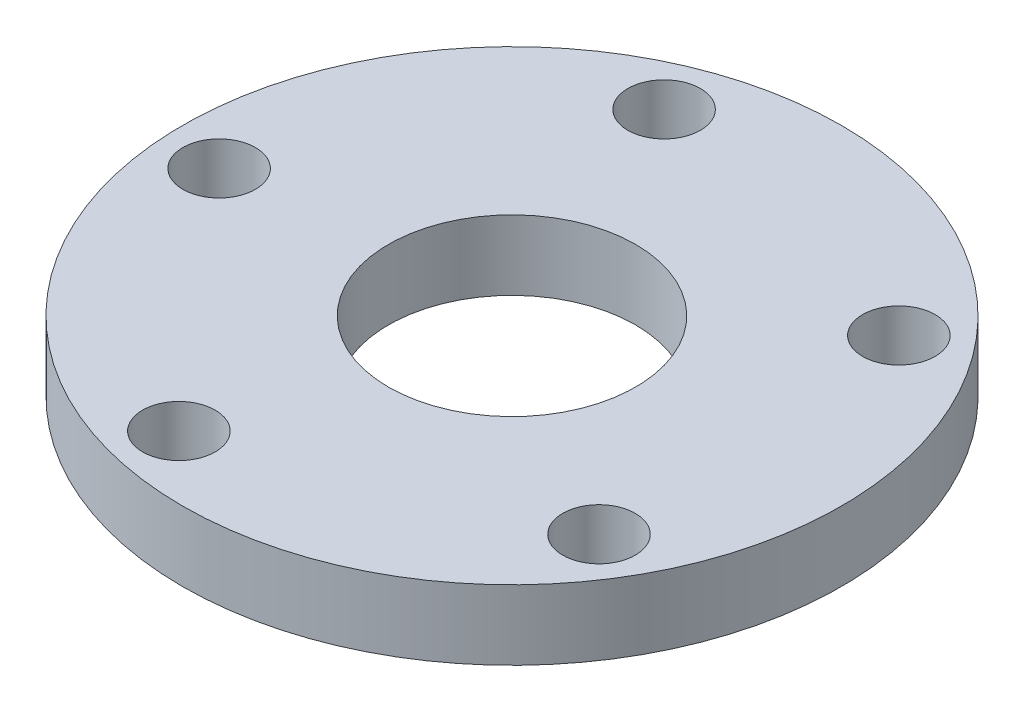
ISO-10303-21;
HEADER;
FILE_DESCRIPTION(('STEP AP214'),'2;1');
FILE_NAME('part.step','',(''),(''),'','','');
FILE_SCHEMA(('AUTOMOTIVE_DESIGN { 1 0 10303 214 1 1 1 1 }'));
ENDSEC;
DATA;
#1=APPLICATION_CONTEXT('core data for automotive mechanical design processes');
#2=APPLICATION_PROTOCOL_DEFINITION('international standard','automotive_design',2000,#1);
#3=PRODUCT_CONTEXT('',#1,'mechanical');
#4=PRODUCT('Part','Part','',(#3));
#5=PRODUCT_RELATED_PRODUCT_CATEGORY('part','',(#4));
#6=PRODUCT_DEFINITION_FORMATION('','',#4);
#7=PRODUCT_DEFINITION_CONTEXT('part definition',#1,'design');
#8=PRODUCT_DEFINITION('design','',#6,#7);
#9=PRODUCT_DEFINITION_SHAPE('','',#8);
#10=(LENGTH_UNIT() NAMED_UNIT(*) SI_UNIT(.MILLI.,.METRE.));
#11=(NAMED_UNIT(*) PLANE_ANGLE_UNIT() SI_UNIT($,.RADIAN.));
#12=(NAMED_UNIT(*) SI_UNIT($,.STERADIAN.) SOLID_ANGLE_UNIT());
#13=UNCERTAINTY_MEASURE_WITH_UNIT(LENGTH_MEASURE(1.E-05),#10,'distance_accuracy_value','');
#14=(GEOMETRIC_REPRESENTATION_CONTEXT(3) GLOBAL_UNCERTAINTY_ASSIGNED_CONTEXT((#13)) GLOBAL_UNIT_ASSIGNED_CONTEXT((#10,
#11,#12)) REPRESENTATION_CONTEXT('',''));
#15=CARTESIAN_POINT('',(0.,0.,0.));
#16=DIRECTION('',(0.,0.,1.));
#17=DIRECTION('',(1.,0.,0.));
#18=AXIS2_PLACEMENT_3D('',#15,#16,#17);
#19=CARTESIAN_POINT('',(0.,0.,60.));
#20=DIRECTION('',(0.,1.,0.));
#21=DIRECTION('',(0.,0.,1.));
#22=AXIS2_PLACEMENT_3D('',#19,#20,#21);
#23=PLANE('',#22);
#24=CARTESIAN_POINT('',(20.6584155924997,0.,6.81089047079327));
#25=DIRECTION('',(0.,1.,0.));
#26=DIRECTION('',(0.,0.,1.));
#27=AXIS2_PLACEMENT_3D('',#24,#25,#26);
#28=CIRCLE('',#27,3.302);
#29=CARTESIAN_POINT('',(20.6584155924997,0.,10.1128904707933));
#30=VERTEX_POINT('',#29);
#31=EDGE_CURVE('E77',#30,#30,#28,.T.);
#32=ORIENTED_EDGE('',*,*,#31,.T.);
#33=EDGE_LOOP('',(#32));
#34=FACE_BOUND('',#33,.T.);
#35=CARTESIAN_POINT('',(49.167445388529,0.,13.949796347778));
#36=DIRECTION('',(0.,1.,0.));
#37=DIRECTION('',(0.,0.,1.));
#38=AXIS2_PLACEMENT_3D('',#35,#36,#37);
#39=CIRCLE('',#38,3.302);
#40=CARTESIAN_POINT('',(49.167445388529,0.,17.251796347778));
#41=VERTEX_POINT('',#40);
#42=EDGE_CURVE('E101',#41,#41,#39,.T.);
#43=ORIENTED_EDGE('',*,*,#42,.T.);
#44=EDGE_LOOP('',(#43));
#45=FACE_BOUND('',#44,.T.);
#46=CARTESIAN_POINT('',(51.1877171351196,0.,43.2695381457758));
#47=DIRECTION('',(0.,1.,0.));
#48=DIRECTION('',(0.,0.,1.));
#49=AXIS2_PLACEMENT_3D('',#46,#47,#48);
#50=CIRCLE('',#49,3.30199999999999);
#51=CARTESIAN_POINT('',(51.1877171351196,0.,46.5715381457758));
#52=VERTEX_POINT('',#51);
#53=EDGE_CURVE('E95',#52,#52,#50,.T.);
#54=ORIENTED_EDGE('',*,*,#53,.T.);
#55=EDGE_LOOP('',(#54));
#56=FACE_BOUND('',#55,.T.);
#57=CARTESIAN_POINT('',(23.9272839449945,0.,54.2512292413247));
#58=DIRECTION('',(0.,1.,0.));
#59=DIRECTION('',(0.,0.,1.));
#60=AXIS2_PLACEMENT_3D('',#57,#58,#59);
#61=CIRCLE('',#60,3.302);
#62=CARTESIAN_POINT('',(23.9272839449945,0.,57.5532292413247));
#63=VERTEX_POINT('',#62);
#64=EDGE_CURVE('E89',#63,#63,#61,.T.);
#65=ORIENTED_EDGE('',*,*,#64,.T.);
#66=EDGE_LOOP('',(#65));
#67=FACE_BOUND('',#66,.T.);
#68=CARTESIAN_POINT('',(5.05913793886075,0.,31.7185457943282));
#69=DIRECTION('',(0.,1.,0.));
#70=DIRECTION('',(0.,0.,1.));
#71=AXIS2_PLACEMENT_3D('',#68,#69,#70);
#72=CIRCLE('',#71,3.302);
#73=CARTESIAN_POINT('',(5.05913793886075,0.,35.0205457943282));
#74=VERTEX_POINT('',#73);
#75=EDGE_CURVE('E82',#74,#74,#72,.T.);
#76=ORIENTED_EDGE('',*,*,#75,.T.);
#77=EDGE_LOOP('',(#76));
#78=FACE_BOUND('',#77,.T.);
#79=CARTESIAN_POINT('',(30.,0.,30.));
#80=DIRECTION('',(0.,1.,0.));
#81=DIRECTION('',(0.,0.,1.));
#82=AXIS2_PLACEMENT_3D('',#79,#80,#81);
#83=CIRCLE('',#82,11.25);
#84=CARTESIAN_POINT('',(30.,0.,41.25));
#85=VERTEX_POINT('',#84);
#86=EDGE_CURVE('E11',#85,#85,#83,.T.);
#87=ORIENTED_EDGE('',*,*,#86,.T.);
#88=EDGE_LOOP('',(#87));
#89=FACE_BOUND('',#88,.T.);
#90=CARTESIAN_POINT('',(30.,0.,30.));
#91=DIRECTION('',(0.,1.,0.));
#92=DIRECTION('',(0.,0.,1.));
#93=AXIS2_PLACEMENT_3D('',#90,#91,#92);
#94=CIRCLE('',#93,30.);
#95=CARTESIAN_POINT('',(30.,0.,60.));
#96=VERTEX_POINT('',#95);
#97=EDGE_CURVE('E83',#96,#96,#94,.T.);
#98=ORIENTED_EDGE('',*,*,#97,.F.);
#99=EDGE_LOOP('',(#98));
#100=FACE_BOUND('',#99,.T.);
#101=ADVANCED_FACE('F67',(#34,#45,#56,#67,#78,#89,#100),#23,.F.);
#102=CARTESIAN_POINT('',(0.,6.35,60.));
#103=DIRECTION('',(0.,-1.,0.));
#104=DIRECTION('',(0.,0.,-1.));
#105=AXIS2_PLACEMENT_3D('',#102,#103,#104);
#106=PLANE('',#105);
#107=CARTESIAN_POINT('',(20.6584155924997,6.35,6.81089047079327));
#108=DIRECTION('',(0.,1.,0.));
#109=DIRECTION('',(0.,0.,1.));
#110=AXIS2_PLACEMENT_3D('',#107,#108,#109);
#111=CIRCLE('',#110,3.302);
#112=CARTESIAN_POINT('',(20.6584155924997,6.35,10.1128904707933));
#113=VERTEX_POINT('',#112);
#114=EDGE_CURVE('E104',#113,#113,#111,.T.);
#115=ORIENTED_EDGE('',*,*,#114,.F.);
#116=EDGE_LOOP('',(#115));
#117=FACE_BOUND('',#116,.T.);
#118=CARTESIAN_POINT('',(49.167445388529,6.35,13.949796347778));
#119=DIRECTION('',(0.,1.,0.));
#120=DIRECTION('',(0.,0.,1.));
#121=AXIS2_PLACEMENT_3D('',#118,#119,#120);
#122=CIRCLE('',#121,3.302);
#123=CARTESIAN_POINT('',(49.167445388529,6.35,17.251796347778));
#124=VERTEX_POINT('',#123);
#125=EDGE_CURVE('E98',#124,#124,#122,.T.);
#126=ORIENTED_EDGE('',*,*,#125,.F.);
#127=EDGE_LOOP('',(#126));
#128=FACE_BOUND('',#127,.T.);
#129=CARTESIAN_POINT('',(51.1877171351196,6.35,43.2695381457758));
#130=DIRECTION('',(0.,1.,0.));
#131=DIRECTION('',(0.,0.,1.));
#132=AXIS2_PLACEMENT_3D('',#129,#130,#131);
#133=CIRCLE('',#132,3.30199999999999);
#134=CARTESIAN_POINT('',(51.1877171351196,6.35,46.5715381457758));
#135=VERTEX_POINT('',#134);
#136=EDGE_CURVE('E92',#135,#135,#133,.T.);
#137=ORIENTED_EDGE('',*,*,#136,.F.);
#138=EDGE_LOOP('',(#137));
#139=FACE_BOUND('',#138,.T.);
#140=CARTESIAN_POINT('',(23.9272839449945,6.35,54.2512292413247));
#141=DIRECTION('',(0.,1.,0.));
#142=DIRECTION('',(0.,0.,1.));
#143=AXIS2_PLACEMENT_3D('',#140,#141,#142);
#144=CIRCLE('',#143,3.302);
#145=CARTESIAN_POINT('',(23.9272839449945,6.35,57.5532292413247));
#146=VERTEX_POINT('',#145);
#147=EDGE_CURVE('E86',#146,#146,#144,.T.);
#148=ORIENTED_EDGE('',*,*,#147,.F.);
#149=EDGE_LOOP('',(#148));
#150=FACE_BOUND('',#149,.T.);
#151=CARTESIAN_POINT('',(5.05913793886075,6.35,31.7185457943282));
#152=DIRECTION('',(0.,1.,0.));
#153=DIRECTION('',(0.,0.,1.));
#154=AXIS2_PLACEMENT_3D('',#151,#152,#153);
#155=CIRCLE('',#154,3.302);
#156=CARTESIAN_POINT('',(5.05913793886075,6.35,35.0205457943282));
#157=VERTEX_POINT('',#156);
#158=EDGE_CURVE('E79',#157,#157,#155,.T.);
#159=ORIENTED_EDGE('',*,*,#158,.F.);
#160=EDGE_LOOP('',(#159));
#161=FACE_BOUND('',#160,.T.);
#162=CARTESIAN_POINT('',(30.,6.35,30.));
#163=DIRECTION('',(0.,1.,0.));
#164=DIRECTION('',(0.,0.,1.));
#165=AXIS2_PLACEMENT_3D('',#162,#163,#164);
#166=CIRCLE('',#165,11.25);
#167=CARTESIAN_POINT('',(30.,6.35,41.25));
#168=VERTEX_POINT('',#167);
#169=EDGE_CURVE('E70',#168,#168,#166,.T.);
#170=ORIENTED_EDGE('',*,*,#169,.F.);
#171=EDGE_LOOP('',(#170));
#172=FACE_BOUND('',#171,.T.);
#173=CARTESIAN_POINT('',(30.,6.35,30.));
#174=DIRECTION('',(0.,1.,0.));
#175=DIRECTION('',(0.,0.,1.));
#176=AXIS2_PLACEMENT_3D('',#173,#174,#175);
#177=CIRCLE('',#176,30.);
#178=CARTESIAN_POINT('',(30.,6.35,60.));
#179=VERTEX_POINT('',#178);
#180=EDGE_CURVE('E109',#179,#179,#177,.T.);
#181=ORIENTED_EDGE('',*,*,#180,.T.);
#182=EDGE_LOOP('',(#181));
#183=FACE_BOUND('',#182,.T.);
#184=ADVANCED_FACE('F118',(#117,#128,#139,#150,#161,#172,#183),#106,.F.);
#185=CARTESIAN_POINT('',(30.,0.,30.));
#186=DIRECTION('',(0.,1.,0.));
#187=DIRECTION('',(0.,0.,1.));
#188=AXIS2_PLACEMENT_3D('',#185,#186,#187);
#189=CYLINDRICAL_SURFACE('',#188,11.25);
#190=ORIENTED_EDGE('',*,*,#86,.F.);
#191=EDGE_LOOP('',(#190));
#192=FACE_BOUND('',#191,.T.);
#193=ORIENTED_EDGE('',*,*,#169,.T.);
#194=EDGE_LOOP('',(#193));
#195=FACE_BOUND('',#194,.T.);
#196=ADVANCED_FACE('F124',(#192,#195),#189,.F.);
#197=CARTESIAN_POINT('',(5.05913793886075,0.,31.7185457943282));
#198=DIRECTION('',(0.,1.,0.));
#199=DIRECTION('',(0.,0.,1.));
#200=AXIS2_PLACEMENT_3D('',#197,#198,#199);
#201=CYLINDRICAL_SURFACE('',#200,3.302);
#202=ORIENTED_EDGE('',*,*,#75,.F.);
#203=EDGE_LOOP('',(#202));
#204=FACE_BOUND('',#203,.T.);
#205=ORIENTED_EDGE('',*,*,#158,.T.);
#206=EDGE_LOOP('',(#205));
#207=FACE_BOUND('',#206,.T.);
#208=ADVANCED_FACE('F136',(#204,#207),#201,.F.);
#209=CARTESIAN_POINT('',(23.9272839449945,0.,54.2512292413247));
#210=DIRECTION('',(0.,1.,0.));
#211=DIRECTION('',(0.,0.,1.));
#212=AXIS2_PLACEMENT_3D('',#209,#210,#211);
#213=CYLINDRICAL_SURFACE('',#212,3.302);
#214=ORIENTED_EDGE('',*,*,#64,.F.);
#215=EDGE_LOOP('',(#214));
#216=FACE_BOUND('',#215,.T.);
#217=ORIENTED_EDGE('',*,*,#147,.T.);
#218=EDGE_LOOP('',(#217));
#219=FACE_BOUND('',#218,.T.);
#220=ADVANCED_FACE('F139',(#216,#219),#213,.F.);
#221=CARTESIAN_POINT('',(51.1877171351196,0.,43.2695381457758));
#222=DIRECTION('',(0.,1.,0.));
#223=DIRECTION('',(0.,0.,1.));
#224=AXIS2_PLACEMENT_3D('',#221,#222,#223);
#225=CYLINDRICAL_SURFACE('',#224,3.30199999999999);
#226=ORIENTED_EDGE('',*,*,#53,.F.);
#227=EDGE_LOOP('',(#226));
#228=FACE_BOUND('',#227,.T.);
#229=ORIENTED_EDGE('',*,*,#136,.T.);
#230=EDGE_LOOP('',(#229));
#231=FACE_BOUND('',#230,.T.);
#232=ADVANCED_FACE('F160',(#228,#231),#225,.F.);
#233=CARTESIAN_POINT('',(49.167445388529,0.,13.949796347778));
#234=DIRECTION('',(0.,1.,0.));
#235=DIRECTION('',(0.,0.,1.));
#236=AXIS2_PLACEMENT_3D('',#233,#234,#235);
#237=CYLINDRICAL_SURFACE('',#236,3.302);
#238=ORIENTED_EDGE('',*,*,#42,.F.);
#239=EDGE_LOOP('',(#238));
#240=FACE_BOUND('',#239,.T.);
#241=ORIENTED_EDGE('',*,*,#125,.T.);
#242=EDGE_LOOP('',(#241));
#243=FACE_BOUND('',#242,.T.);
#244=ADVANCED_FACE('F154',(#240,#243),#237,.F.);
#245=CARTESIAN_POINT('',(20.6584155924997,0.,6.81089047079327));
#246=DIRECTION('',(0.,1.,0.));
#247=DIRECTION('',(0.,0.,1.));
#248=AXIS2_PLACEMENT_3D('',#245,#246,#247);
#249=CYLINDRICAL_SURFACE('',#248,3.302);
#250=ORIENTED_EDGE('',*,*,#31,.F.);
#251=EDGE_LOOP('',(#250));
#252=FACE_BOUND('',#251,.T.);
#253=ORIENTED_EDGE('',*,*,#114,.T.);
#254=EDGE_LOOP('',(#253));
#255=FACE_BOUND('',#254,.T.);
#256=ADVANCED_FACE('F149',(#252,#255),#249,.F.);
#257=CARTESIAN_POINT('',(30.,0.,30.));
#258=DIRECTION('',(0.,1.,0.));
#259=DIRECTION('',(0.,0.,1.));
#260=AXIS2_PLACEMENT_3D('',#257,#258,#259);
#261=CYLINDRICAL_SURFACE('',#260,30.);
#262=ORIENTED_EDGE('',*,*,#180,.F.);
#263=EDGE_LOOP('',(#262));
#264=FACE_BOUND('',#263,.T.);
#265=ORIENTED_EDGE('',*,*,#97,.T.);
#266=EDGE_LOOP('',(#265));
#267=FACE_BOUND('',#266,.T.);
#268=ADVANCED_FACE('F115',(#264,#267),#261,.T.);
#269=CLOSED_SHELL('',(#101,#184,#196,#208,#220,#232,#244,#256,#268));
#270=MANIFOLD_SOLID_BREP('B2',#269);
#271=ADVANCED_BREP_SHAPE_REPRESENTATION('',(#18,#270),#14);
#272=SHAPE_DEFINITION_REPRESENTATION(#9,#271);
ENDSEC;
END-ISO-10303-21;
